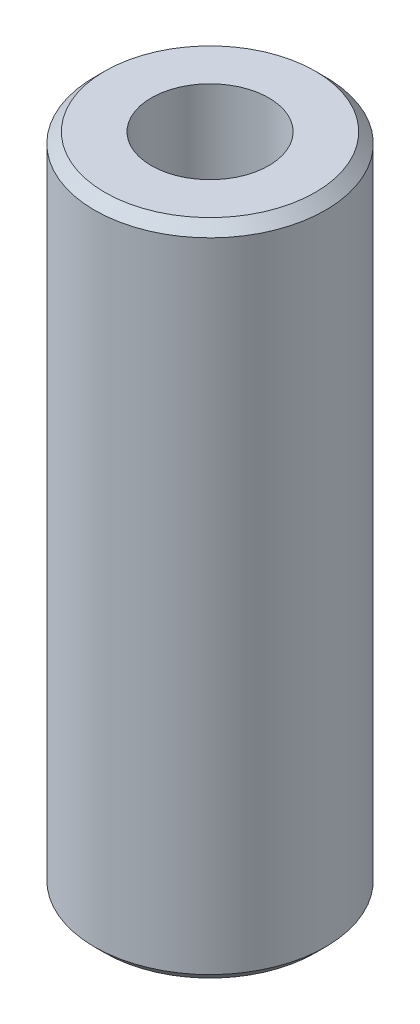
ISO-10303-21;
HEADER;
FILE_DESCRIPTION(('STEP AP214'),'2;1');
FILE_NAME('part.step','',(''),(''),'','','');
FILE_SCHEMA(('AUTOMOTIVE_DESIGN { 1 0 10303 214 1 1 1 1 }'));
ENDSEC;
DATA;
#1=APPLICATION_CONTEXT('core data for automotive mechanical design processes');
#2=APPLICATION_PROTOCOL_DEFINITION('international standard','automotive_design',2000,#1);
#3=PRODUCT_CONTEXT('',#1,'mechanical');
#4=PRODUCT('Part','Part','',(#3));
#5=PRODUCT_RELATED_PRODUCT_CATEGORY('part','',(#4));
#6=PRODUCT_DEFINITION_FORMATION('','',#4);
#7=PRODUCT_DEFINITION_CONTEXT('part definition',#1,'design');
#8=PRODUCT_DEFINITION('design','',#6,#7);
#9=PRODUCT_DEFINITION_SHAPE('','',#8);
#10=(LENGTH_UNIT() NAMED_UNIT(*) SI_UNIT(.MILLI.,.METRE.));
#11=(NAMED_UNIT(*) PLANE_ANGLE_UNIT() SI_UNIT($,.RADIAN.));
#12=(NAMED_UNIT(*) SI_UNIT($,.STERADIAN.) SOLID_ANGLE_UNIT());
#13=UNCERTAINTY_MEASURE_WITH_UNIT(LENGTH_MEASURE(1.E-05),#10,'distance_accuracy_value','');
#14=(GEOMETRIC_REPRESENTATION_CONTEXT(3) GLOBAL_UNCERTAINTY_ASSIGNED_CONTEXT((#13)) GLOBAL_UNIT_ASSIGNED_CONTEXT((#10,
#11,#12)) REPRESENTATION_CONTEXT('',''));
#15=CARTESIAN_POINT('',(0.,0.,0.));
#16=DIRECTION('',(0.,0.,1.));
#17=DIRECTION('',(1.,0.,0.));
#18=AXIS2_PLACEMENT_3D('',#15,#16,#17);
#19=CARTESIAN_POINT('',(0.,171.15994389574,0.));
#20=DIRECTION('',(0.,-1.,0.));
#21=DIRECTION('',(0.,0.,-1.));
#22=AXIS2_PLACEMENT_3D('',#19,#20,#21);
#23=CYLINDRICAL_SURFACE('',#22,30.);
#24=CARTESIAN_POINT('',(0.,168.48872867908,0.));
#25=DIRECTION('',(0.,1.,0.));
#26=DIRECTION('',(0.,0.,1.));
#27=AXIS2_PLACEMENT_3D('',#24,#25,#26);
#28=CIRCLE('',#27,30.);
#29=CARTESIAN_POINT('',(0.,168.48872867908,30.));
#30=VERTEX_POINT('',#29);
#31=EDGE_CURVE('E50',#30,#30,#28,.F.);
#32=ORIENTED_EDGE('',*,*,#31,.T.);
#33=EDGE_LOOP('',(#32));
#34=FACE_BOUND('',#33,.T.);
#35=CARTESIAN_POINT('',(0.,2.67121521666,0.));
#36=DIRECTION('',(0.,1.,0.));
#37=DIRECTION('',(0.,0.,1.));
#38=AXIS2_PLACEMENT_3D('',#35,#36,#37);
#39=CIRCLE('',#38,30.);
#40=CARTESIAN_POINT('',(0.,2.67121521666,30.));
#41=VERTEX_POINT('',#40);
#42=EDGE_CURVE('E51',#41,#41,#39,.T.);
#43=ORIENTED_EDGE('',*,*,#42,.T.);
#44=EDGE_LOOP('',(#43));
#45=FACE_BOUND('',#44,.T.);
#46=ADVANCED_FACE('F39',(#34,#45),#23,.T.);
#47=CARTESIAN_POINT('',(0.,171.15994389574,0.));
#48=DIRECTION('',(0.,1.,0.));
#49=DIRECTION('',(0.,0.,1.));
#50=AXIS2_PLACEMENT_3D('',#47,#48,#49);
#51=PLANE('',#50);
#52=CARTESIAN_POINT('',(0.,171.15994389574,0.));
#53=DIRECTION('',(0.,1.,0.));
#54=DIRECTION('',(0.,0.,1.));
#55=AXIS2_PLACEMENT_3D('',#52,#53,#54);
#56=CIRCLE('',#55,27.32878478334);
#57=CARTESIAN_POINT('',(0.,171.15994389574,27.32878478334));
#58=VERTEX_POINT('',#57);
#59=EDGE_CURVE('E54',#58,#58,#56,.T.);
#60=ORIENTED_EDGE('',*,*,#59,.T.);
#61=EDGE_LOOP('',(#60));
#62=FACE_BOUND('',#61,.T.);
#63=CARTESIAN_POINT('',(0.,171.15994389574,0.));
#64=DIRECTION('',(0.,1.,0.));
#65=DIRECTION('',(0.,0.,1.));
#66=AXIS2_PLACEMENT_3D('',#63,#64,#65);
#67=CIRCLE('',#66,15.2685972965221);
#68=CARTESIAN_POINT('',(0.,171.15994389574,15.2685972965221));
#69=VERTEX_POINT('',#68);
#70=EDGE_CURVE('E58',#69,#69,#67,.T.);
#71=ORIENTED_EDGE('',*,*,#70,.F.);
#72=EDGE_LOOP('',(#71));
#73=FACE_BOUND('',#72,.T.);
#74=ADVANCED_FACE('F69',(#62,#73),#51,.T.);
#75=CARTESIAN_POINT('',(0.,0.,0.));
#76=DIRECTION('',(0.,1.,0.));
#77=DIRECTION('',(0.,0.,1.));
#78=AXIS2_PLACEMENT_3D('',#75,#76,#77);
#79=PLANE('',#78);
#80=CARTESIAN_POINT('',(0.,0.,0.));
#81=DIRECTION('',(0.,1.,0.));
#82=DIRECTION('',(0.,0.,1.));
#83=AXIS2_PLACEMENT_3D('',#80,#81,#82);
#84=CIRCLE('',#83,27.3287847833399);
#85=CARTESIAN_POINT('',(0.,0.,27.3287847833399));
#86=VERTEX_POINT('',#85);
#87=EDGE_CURVE('E10',#86,#86,#84,.F.);
#88=ORIENTED_EDGE('',*,*,#87,.T.);
#89=EDGE_LOOP('',(#88));
#90=FACE_BOUND('',#89,.T.);
#91=CARTESIAN_POINT('',(0.,0.,0.));
#92=DIRECTION('',(0.,1.,0.));
#93=DIRECTION('',(0.,0.,1.));
#94=AXIS2_PLACEMENT_3D('',#91,#92,#93);
#95=CIRCLE('',#94,15.2685972965221);
#96=CARTESIAN_POINT('',(0.,0.,15.2685972965221));
#97=VERTEX_POINT('',#96);
#98=EDGE_CURVE('E63',#97,#97,#95,.T.);
#99=ORIENTED_EDGE('',*,*,#98,.T.);
#100=EDGE_LOOP('',(#99));
#101=FACE_BOUND('',#100,.T.);
#102=ADVANCED_FACE('F75',(#90,#101),#79,.F.);
#103=CARTESIAN_POINT('',(0.,171.15994389574,0.));
#104=DIRECTION('',(0.,-1.,0.));
#105=DIRECTION('',(0.,0.,-1.));
#106=AXIS2_PLACEMENT_3D('',#103,#104,#105);
#107=CYLINDRICAL_SURFACE('',#106,15.2685972965221);
#108=ORIENTED_EDGE('',*,*,#70,.T.);
#109=EDGE_LOOP('',(#108));
#110=FACE_BOUND('',#109,.T.);
#111=ORIENTED_EDGE('',*,*,#98,.F.);
#112=EDGE_LOOP('',(#111));
#113=FACE_BOUND('',#112,.T.);
#114=ADVANCED_FACE('F70',(#110,#113),#107,.F.);
#115=CARTESIAN_POINT('',(0.,171.15994389574,0.));
#116=DIRECTION('',(0.,-1.,0.));
#117=DIRECTION('',(0.,0.,-1.));
#118=AXIS2_PLACEMENT_3D('',#115,#116,#117);
#119=CONICAL_SURFACE('',#118,27.32878478334,0.785398163397443);
#120=ORIENTED_EDGE('',*,*,#31,.F.);
#121=EDGE_LOOP('',(#120));
#122=FACE_BOUND('',#121,.T.);
#123=ORIENTED_EDGE('',*,*,#59,.F.);
#124=EDGE_LOOP('',(#123));
#125=FACE_BOUND('',#124,.T.);
#126=ADVANCED_FACE('F81',(#122,#125),#119,.T.);
#127=CARTESIAN_POINT('',(0.,2.67121521666,0.));
#128=DIRECTION('',(0.,1.,0.));
#129=DIRECTION('',(0.,0.,1.));
#130=AXIS2_PLACEMENT_3D('',#127,#128,#129);
#131=CONICAL_SURFACE('',#130,30.,0.785398163397459);
#132=ORIENTED_EDGE('',*,*,#87,.F.);
#133=EDGE_LOOP('',(#132));
#134=FACE_BOUND('',#133,.T.);
#135=ORIENTED_EDGE('',*,*,#42,.F.);
#136=EDGE_LOOP('',(#135));
#137=FACE_BOUND('',#136,.T.);
#138=ADVANCED_FACE('F45',(#134,#137),#131,.T.);
#139=CLOSED_SHELL('',(#46,#74,#102,#114,#126,#138));
#140=MANIFOLD_SOLID_BREP('B2',#139);
#141=ADVANCED_BREP_SHAPE_REPRESENTATION('',(#18,#140),#14);
#142=SHAPE_DEFINITION_REPRESENTATION(#9,#141);
ENDSEC;
END-ISO-10303-21;
